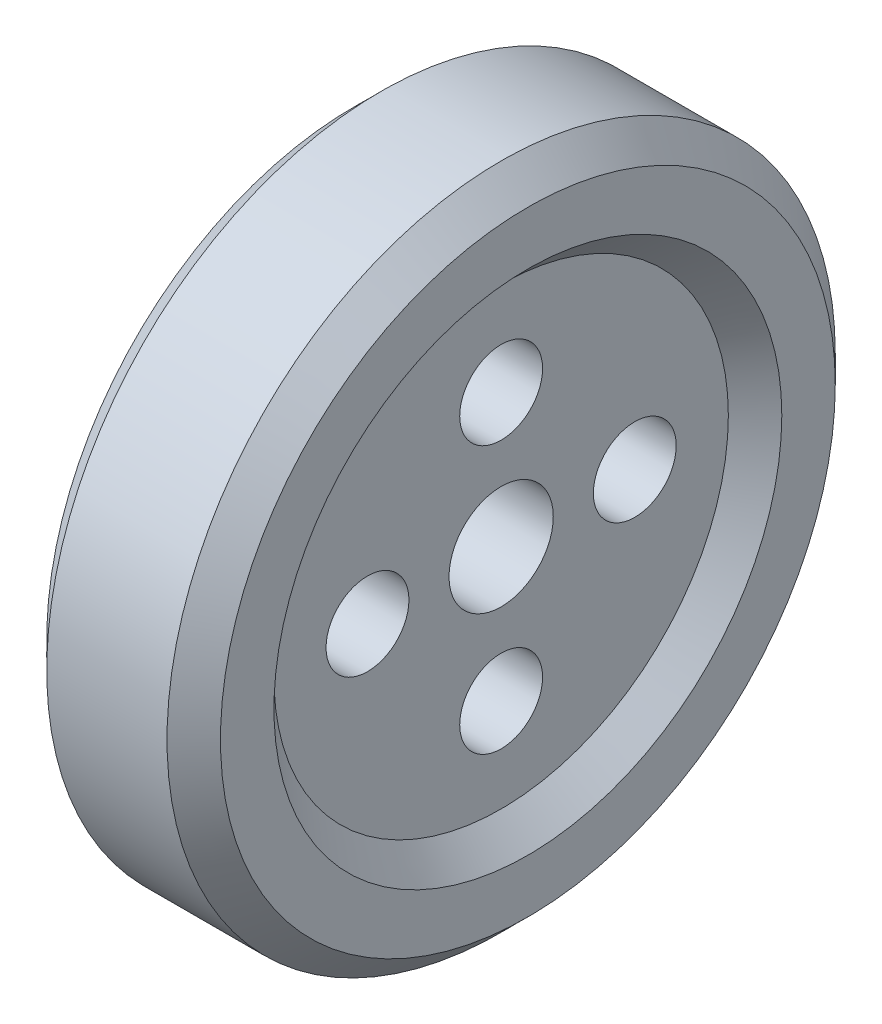
ISO-10303-21;
HEADER;
FILE_DESCRIPTION(('STEP AP214'),'2;1');
FILE_NAME('part.step','',(''),(''),'','','');
FILE_SCHEMA(('AUTOMOTIVE_DESIGN { 1 0 10303 214 1 1 1 1 }'));
ENDSEC;
DATA;
#1=APPLICATION_CONTEXT('core data for automotive mechanical design processes');
#2=APPLICATION_PROTOCOL_DEFINITION('international standard','automotive_design',2000,#1);
#3=PRODUCT_CONTEXT('',#1,'mechanical');
#4=PRODUCT('Part','Part','',(#3));
#5=PRODUCT_RELATED_PRODUCT_CATEGORY('part','',(#4));
#6=PRODUCT_DEFINITION_FORMATION('','',#4);
#7=PRODUCT_DEFINITION_CONTEXT('part definition',#1,'design');
#8=PRODUCT_DEFINITION('design','',#6,#7);
#9=PRODUCT_DEFINITION_SHAPE('','',#8);
#10=(LENGTH_UNIT() NAMED_UNIT(*) SI_UNIT(.MILLI.,.METRE.));
#11=(NAMED_UNIT(*) PLANE_ANGLE_UNIT() SI_UNIT($,.RADIAN.));
#12=(NAMED_UNIT(*) SI_UNIT($,.STERADIAN.) SOLID_ANGLE_UNIT());
#13=UNCERTAINTY_MEASURE_WITH_UNIT(LENGTH_MEASURE(1.E-05),#10,'distance_accuracy_value','');
#14=(GEOMETRIC_REPRESENTATION_CONTEXT(3) GLOBAL_UNCERTAINTY_ASSIGNED_CONTEXT((#13)) GLOBAL_UNIT_ASSIGNED_CONTEXT((#10,
#11,#12)) REPRESENTATION_CONTEXT('',''));
#15=CARTESIAN_POINT('',(0.,0.,0.));
#16=DIRECTION('',(0.,0.,1.));
#17=DIRECTION('',(1.,0.,0.));
#18=AXIS2_PLACEMENT_3D('',#15,#16,#17);
#19=CARTESIAN_POINT('',(-928.470993895784,140.989010989011,0.));
#20=DIRECTION('',(-1.,0.,0.));
#21=DIRECTION('',(0.,0.,1.));
#22=AXIS2_PLACEMENT_3D('',#19,#20,#21);
#23=CONICAL_SURFACE('',#22,190.,0.785398163397454);
#24=CARTESIAN_POINT('',(-908.470993895784,140.989010989011,0.));
#25=DIRECTION('',(1.,0.,0.));
#26=DIRECTION('',(0.,0.,-1.));
#27=AXIS2_PLACEMENT_3D('',#24,#25,#26);
#28=CIRCLE('',#27,170.);
#29=CARTESIAN_POINT('',(-908.470993895784,140.989010989011,-170.));
#30=VERTEX_POINT('',#29);
#31=EDGE_CURVE('E10',#30,#30,#28,.T.);
#32=ORIENTED_EDGE('',*,*,#31,.T.);
#33=EDGE_LOOP('',(#32));
#34=FACE_BOUND('',#33,.T.);
#35=CARTESIAN_POINT('',(-928.470993895784,140.989010989011,0.));
#36=DIRECTION('',(1.,0.,0.));
#37=DIRECTION('',(0.,0.,-1.));
#38=AXIS2_PLACEMENT_3D('',#35,#36,#37);
#39=CIRCLE('',#38,190.);
#40=CARTESIAN_POINT('',(-928.470993895784,140.989010989011,-190.));
#41=VERTEX_POINT('',#40);
#42=EDGE_CURVE('E50',#41,#41,#39,.T.);
#43=ORIENTED_EDGE('',*,*,#42,.F.);
#44=EDGE_LOOP('',(#43));
#45=FACE_BOUND('',#44,.T.);
#46=ADVANCED_FACE('F31',(#34,#45),#23,.F.);
#47=CARTESIAN_POINT('',(-908.470993895784,310.989010989011,0.));
#48=DIRECTION('',(-1.,0.,0.));
#49=DIRECTION('',(0.,0.,1.));
#50=AXIS2_PLACEMENT_3D('',#47,#48,#49);
#51=PLANE('',#50);
#52=CARTESIAN_POINT('',(-908.470993895784,40.989010989011,-1.08246744900953E-12));
#53=DIRECTION('',(-1.,0.,0.));
#54=DIRECTION('',(0.,0.,1.));
#55=AXIS2_PLACEMENT_3D('',#52,#53,#54);
#56=CIRCLE('',#55,31.);
#57=CARTESIAN_POINT('',(-908.470993895784,40.989010989011,30.9999999999989));
#58=VERTEX_POINT('',#57);
#59=EDGE_CURVE('E160',#58,#58,#56,.T.);
#60=ORIENTED_EDGE('',*,*,#59,.F.);
#61=EDGE_LOOP('',(#60));
#62=FACE_BOUND('',#61,.T.);
#63=CARTESIAN_POINT('',(-908.470993895784,140.98901098901,100.));
#64=DIRECTION('',(-1.,0.,0.));
#65=DIRECTION('',(0.,0.,1.));
#66=AXIS2_PLACEMENT_3D('',#63,#64,#65);
#67=CIRCLE('',#66,31.);
#68=CARTESIAN_POINT('',(-908.470993895784,140.98901098901,131.));
#69=VERTEX_POINT('',#68);
#70=EDGE_CURVE('E158',#69,#69,#67,.T.);
#71=ORIENTED_EDGE('',*,*,#70,.F.);
#72=EDGE_LOOP('',(#71));
#73=FACE_BOUND('',#72,.T.);
#74=CARTESIAN_POINT('',(-908.470993895784,240.989010989011,3.88578058618805E-13));
#75=DIRECTION('',(-1.,0.,0.));
#76=DIRECTION('',(0.,0.,1.));
#77=AXIS2_PLACEMENT_3D('',#74,#75,#76);
#78=CIRCLE('',#77,31.);
#79=CARTESIAN_POINT('',(-908.470993895784,240.989010989011,31.0000000000004));
#80=VERTEX_POINT('',#79);
#81=EDGE_CURVE('E71',#80,#80,#78,.T.);
#82=ORIENTED_EDGE('',*,*,#81,.F.);
#83=EDGE_LOOP('',(#82));
#84=FACE_BOUND('',#83,.T.);
#85=CARTESIAN_POINT('',(-908.470993895784,140.989010989011,-100.));
#86=DIRECTION('',(-1.,0.,0.));
#87=DIRECTION('',(0.,0.,1.));
#88=AXIS2_PLACEMENT_3D('',#85,#86,#87);
#89=CIRCLE('',#88,31.);
#90=CARTESIAN_POINT('',(-908.470993895784,140.989010989011,-69.));
#91=VERTEX_POINT('',#90);
#92=EDGE_CURVE('E56',#91,#91,#89,.T.);
#93=ORIENTED_EDGE('',*,*,#92,.F.);
#94=EDGE_LOOP('',(#93));
#95=FACE_BOUND('',#94,.T.);
#96=CARTESIAN_POINT('',(-908.470993895784,140.989010989011,0.));
#97=DIRECTION('',(-1.,0.,0.));
#98=DIRECTION('',(0.,0.,1.));
#99=AXIS2_PLACEMENT_3D('',#96,#97,#98);
#100=CIRCLE('',#99,39.);
#101=CARTESIAN_POINT('',(-908.470993895784,140.989010989011,39.));
#102=VERTEX_POINT('',#101);
#103=EDGE_CURVE('E51',#102,#102,#100,.T.);
#104=ORIENTED_EDGE('',*,*,#103,.F.);
#105=EDGE_LOOP('',(#104));
#106=FACE_BOUND('',#105,.T.);
#107=ORIENTED_EDGE('',*,*,#31,.F.);
#108=EDGE_LOOP('',(#107));
#109=FACE_BOUND('',#108,.T.);
#110=ADVANCED_FACE('F107',(#62,#73,#84,#95,#106,#109),#51,.T.);
#111=CARTESIAN_POINT('',(-818.470993895784,310.989010989011,0.));
#112=DIRECTION('',(1.,0.,0.));
#113=DIRECTION('',(0.,0.,-1.));
#114=AXIS2_PLACEMENT_3D('',#111,#112,#113);
#115=PLANE('',#114);
#116=CARTESIAN_POINT('',(-818.470993895784,40.989010989011,-1.08246744900953E-12));
#117=DIRECTION('',(1.,0.,0.));
#118=DIRECTION('',(0.,0.,-1.));
#119=AXIS2_PLACEMENT_3D('',#116,#117,#118);
#120=CIRCLE('',#119,31.);
#121=CARTESIAN_POINT('',(-818.470993895784,40.989010989011,-31.0000000000011));
#122=VERTEX_POINT('',#121);
#123=EDGE_CURVE('E34',#122,#122,#120,.T.);
#124=ORIENTED_EDGE('',*,*,#123,.F.);
#125=EDGE_LOOP('',(#124));
#126=FACE_BOUND('',#125,.T.);
#127=CARTESIAN_POINT('',(-818.470993895784,140.98901098901,100.));
#128=DIRECTION('',(1.,0.,0.));
#129=DIRECTION('',(0.,0.,-1.));
#130=AXIS2_PLACEMENT_3D('',#127,#128,#129);
#131=CIRCLE('',#130,31.);
#132=CARTESIAN_POINT('',(-818.470993895784,140.98901098901,69.));
#133=VERTEX_POINT('',#132);
#134=EDGE_CURVE('E58',#133,#133,#131,.T.);
#135=ORIENTED_EDGE('',*,*,#134,.F.);
#136=EDGE_LOOP('',(#135));
#137=FACE_BOUND('',#136,.T.);
#138=CARTESIAN_POINT('',(-818.470993895784,240.989010989011,3.88578058618805E-13));
#139=DIRECTION('',(1.,0.,0.));
#140=DIRECTION('',(0.,0.,-1.));
#141=AXIS2_PLACEMENT_3D('',#138,#139,#140);
#142=CIRCLE('',#141,31.);
#143=CARTESIAN_POINT('',(-818.470993895784,240.989010989011,-30.9999999999996));
#144=VERTEX_POINT('',#143);
#145=EDGE_CURVE('E55',#144,#144,#142,.T.);
#146=ORIENTED_EDGE('',*,*,#145,.F.);
#147=EDGE_LOOP('',(#146));
#148=FACE_BOUND('',#147,.T.);
#149=CARTESIAN_POINT('',(-818.470993895784,140.989010989011,-100.));
#150=DIRECTION('',(1.,0.,0.));
#151=DIRECTION('',(0.,0.,-1.));
#152=AXIS2_PLACEMENT_3D('',#149,#150,#151);
#153=CIRCLE('',#152,31.);
#154=CARTESIAN_POINT('',(-818.470993895784,140.989010989011,-131.));
#155=VERTEX_POINT('',#154);
#156=EDGE_CURVE('E52',#155,#155,#153,.T.);
#157=ORIENTED_EDGE('',*,*,#156,.F.);
#158=EDGE_LOOP('',(#157));
#159=FACE_BOUND('',#158,.T.);
#160=CARTESIAN_POINT('',(-818.470993895784,140.989010989011,0.));
#161=DIRECTION('',(1.,0.,0.));
#162=DIRECTION('',(0.,0.,-1.));
#163=AXIS2_PLACEMENT_3D('',#160,#161,#162);
#164=CIRCLE('',#163,39.);
#165=CARTESIAN_POINT('',(-818.470993895784,140.989010989011,-39.));
#166=VERTEX_POINT('',#165);
#167=EDGE_CURVE('E47',#166,#166,#164,.T.);
#168=ORIENTED_EDGE('',*,*,#167,.F.);
#169=EDGE_LOOP('',(#168));
#170=FACE_BOUND('',#169,.T.);
#171=CARTESIAN_POINT('',(-818.470993895784,140.989010989011,0.));
#172=DIRECTION('',(1.,0.,0.));
#173=DIRECTION('',(0.,0.,-1.));
#174=AXIS2_PLACEMENT_3D('',#171,#172,#173);
#175=CIRCLE('',#174,170.);
#176=CARTESIAN_POINT('',(-818.470993895784,140.989010989011,-170.));
#177=VERTEX_POINT('',#176);
#178=EDGE_CURVE('E38',#177,#177,#175,.T.);
#179=ORIENTED_EDGE('',*,*,#178,.T.);
#180=EDGE_LOOP('',(#179));
#181=FACE_BOUND('',#180,.T.);
#182=ADVANCED_FACE('F104',(#126,#137,#148,#159,#170,#181),#115,.T.);
#183=CARTESIAN_POINT('',(-818.470993895784,140.989010989011,0.));
#184=DIRECTION('',(1.,0.,0.));
#185=DIRECTION('',(0.,0.,-1.));
#186=AXIS2_PLACEMENT_3D('',#183,#184,#185);
#187=CONICAL_SURFACE('',#186,170.,0.785398163397448);
#188=CARTESIAN_POINT('',(-798.470993895784,140.989010989011,0.));
#189=DIRECTION('',(1.,0.,0.));
#190=DIRECTION('',(0.,0.,-1.));
#191=AXIS2_PLACEMENT_3D('',#188,#189,#190);
#192=CIRCLE('',#191,190.);
#193=CARTESIAN_POINT('',(-798.470993895784,140.989010989011,-190.));
#194=VERTEX_POINT('',#193);
#195=EDGE_CURVE('E43',#194,#194,#192,.T.);
#196=ORIENTED_EDGE('',*,*,#195,.T.);
#197=EDGE_LOOP('',(#196));
#198=FACE_BOUND('',#197,.T.);
#199=ORIENTED_EDGE('',*,*,#178,.F.);
#200=EDGE_LOOP('',(#199));
#201=FACE_BOUND('',#200,.T.);
#202=ADVANCED_FACE('F89',(#198,#201),#187,.F.);
#203=CARTESIAN_POINT('',(-798.470993895784,370.989010989011,0.));
#204=DIRECTION('',(1.,0.,0.));
#205=DIRECTION('',(0.,0.,-1.));
#206=AXIS2_PLACEMENT_3D('',#203,#204,#205);
#207=PLANE('',#206);
#208=CARTESIAN_POINT('',(-798.470993895784,140.989010989011,0.));
#209=DIRECTION('',(1.,0.,0.));
#210=DIRECTION('',(0.,0.,-1.));
#211=AXIS2_PLACEMENT_3D('',#208,#209,#210);
#212=CIRCLE('',#211,230.);
#213=CARTESIAN_POINT('',(-798.470993895784,140.989010989011,-230.));
#214=VERTEX_POINT('',#213);
#215=EDGE_CURVE('E84',#214,#214,#212,.T.);
#216=ORIENTED_EDGE('',*,*,#215,.T.);
#217=EDGE_LOOP('',(#216));
#218=FACE_BOUND('',#217,.T.);
#219=ORIENTED_EDGE('',*,*,#195,.F.);
#220=EDGE_LOOP('',(#219));
#221=FACE_BOUND('',#220,.T.);
#222=ADVANCED_FACE('F92',(#218,#221),#207,.T.);
#223=CARTESIAN_POINT('',(-798.470993895784,140.989010989011,0.));
#224=DIRECTION('',(-1.,0.,0.));
#225=DIRECTION('',(0.,0.,1.));
#226=AXIS2_PLACEMENT_3D('',#223,#224,#225);
#227=CONICAL_SURFACE('',#226,230.,0.785398163397448);
#228=CARTESIAN_POINT('',(-818.470993895784,140.989010989011,0.));
#229=DIRECTION('',(1.,0.,0.));
#230=DIRECTION('',(0.,0.,-1.));
#231=AXIS2_PLACEMENT_3D('',#228,#229,#230);
#232=CIRCLE('',#231,250.);
#233=CARTESIAN_POINT('',(-818.470993895784,140.989010989011,-250.));
#234=VERTEX_POINT('',#233);
#235=EDGE_CURVE('E81',#234,#234,#232,.T.);
#236=ORIENTED_EDGE('',*,*,#235,.T.);
#237=EDGE_LOOP('',(#236));
#238=FACE_BOUND('',#237,.T.);
#239=ORIENTED_EDGE('',*,*,#215,.F.);
#240=EDGE_LOOP('',(#239));
#241=FACE_BOUND('',#240,.T.);
#242=ADVANCED_FACE('F94',(#238,#241),#227,.T.);
#243=CARTESIAN_POINT('',(-690.973356143631,140.989010989011,0.));
#244=DIRECTION('',(1.,0.,0.));
#245=DIRECTION('',(0.,0.,-1.));
#246=AXIS2_PLACEMENT_3D('',#243,#244,#245);
#247=CYLINDRICAL_SURFACE('',#246,250.);
#248=CARTESIAN_POINT('',(-908.470993895784,140.989010989011,0.));
#249=DIRECTION('',(1.,0.,0.));
#250=DIRECTION('',(0.,0.,-1.));
#251=AXIS2_PLACEMENT_3D('',#248,#249,#250);
#252=CIRCLE('',#251,250.);
#253=CARTESIAN_POINT('',(-908.470993895784,140.989010989011,-250.));
#254=VERTEX_POINT('',#253);
#255=EDGE_CURVE('E78',#254,#254,#252,.T.);
#256=ORIENTED_EDGE('',*,*,#255,.T.);
#257=EDGE_LOOP('',(#256));
#258=FACE_BOUND('',#257,.T.);
#259=ORIENTED_EDGE('',*,*,#235,.F.);
#260=EDGE_LOOP('',(#259));
#261=FACE_BOUND('',#260,.T.);
#262=ADVANCED_FACE('F101',(#258,#261),#247,.T.);
#263=CARTESIAN_POINT('',(-908.470993895784,140.989010989011,0.));
#264=DIRECTION('',(1.,0.,0.));
#265=DIRECTION('',(0.,0.,-1.));
#266=AXIS2_PLACEMENT_3D('',#263,#264,#265);
#267=CONICAL_SURFACE('',#266,250.,0.785398163397448);
#268=CARTESIAN_POINT('',(-928.470993895784,140.989010989011,0.));
#269=DIRECTION('',(1.,0.,0.));
#270=DIRECTION('',(0.,0.,-1.));
#271=AXIS2_PLACEMENT_3D('',#268,#269,#270);
#272=CIRCLE('',#271,230.);
#273=CARTESIAN_POINT('',(-928.470993895784,140.989010989011,-230.));
#274=VERTEX_POINT('',#273);
#275=EDGE_CURVE('E75',#274,#274,#272,.T.);
#276=ORIENTED_EDGE('',*,*,#275,.T.);
#277=EDGE_LOOP('',(#276));
#278=FACE_BOUND('',#277,.T.);
#279=ORIENTED_EDGE('',*,*,#255,.F.);
#280=EDGE_LOOP('',(#279));
#281=FACE_BOUND('',#280,.T.);
#282=ADVANCED_FACE('F119',(#278,#281),#267,.T.);
#283=CARTESIAN_POINT('',(-928.470993895784,370.989010989011,0.));
#284=DIRECTION('',(-1.,0.,0.));
#285=DIRECTION('',(0.,0.,1.));
#286=AXIS2_PLACEMENT_3D('',#283,#284,#285);
#287=PLANE('',#286);
#288=ORIENTED_EDGE('',*,*,#42,.T.);
#289=EDGE_LOOP('',(#288));
#290=FACE_BOUND('',#289,.T.);
#291=ORIENTED_EDGE('',*,*,#275,.F.);
#292=EDGE_LOOP('',(#291));
#293=FACE_BOUND('',#292,.T.);
#294=ADVANCED_FACE('F115',(#290,#293),#287,.T.);
#295=CARTESIAN_POINT('',(-798.470993895784,140.989010989011,0.));
#296=DIRECTION('',(-1.,0.,0.));
#297=DIRECTION('',(0.,0.,1.));
#298=AXIS2_PLACEMENT_3D('',#295,#296,#297);
#299=CYLINDRICAL_SURFACE('',#298,39.);
#300=ORIENTED_EDGE('',*,*,#167,.T.);
#301=EDGE_LOOP('',(#300));
#302=FACE_BOUND('',#301,.T.);
#303=ORIENTED_EDGE('',*,*,#103,.T.);
#304=EDGE_LOOP('',(#303));
#305=FACE_BOUND('',#304,.T.);
#306=ADVANCED_FACE('F118',(#302,#305),#299,.F.);
#307=CARTESIAN_POINT('',(-798.470993895784,140.989010989011,-100.));
#308=DIRECTION('',(-1.,0.,0.));
#309=DIRECTION('',(0.,0.,1.));
#310=AXIS2_PLACEMENT_3D('',#307,#308,#309);
#311=CYLINDRICAL_SURFACE('',#310,31.);
#312=ORIENTED_EDGE('',*,*,#156,.T.);
#313=EDGE_LOOP('',(#312));
#314=FACE_BOUND('',#313,.T.);
#315=ORIENTED_EDGE('',*,*,#92,.T.);
#316=EDGE_LOOP('',(#315));
#317=FACE_BOUND('',#316,.T.);
#318=ADVANCED_FACE('F139',(#314,#317),#311,.F.);
#319=CARTESIAN_POINT('',(-798.470993895784,240.989010989011,3.88578058618805E-13));
#320=DIRECTION('',(-1.,0.,0.));
#321=DIRECTION('',(0.,0.,1.));
#322=AXIS2_PLACEMENT_3D('',#319,#320,#321);
#323=CYLINDRICAL_SURFACE('',#322,31.);
#324=ORIENTED_EDGE('',*,*,#145,.T.);
#325=EDGE_LOOP('',(#324));
#326=FACE_BOUND('',#325,.T.);
#327=ORIENTED_EDGE('',*,*,#81,.T.);
#328=EDGE_LOOP('',(#327));
#329=FACE_BOUND('',#328,.T.);
#330=ADVANCED_FACE('F141',(#326,#329),#323,.F.);
#331=CARTESIAN_POINT('',(-798.470993895784,140.98901098901,100.));
#332=DIRECTION('',(-1.,0.,0.));
#333=DIRECTION('',(0.,0.,1.));
#334=AXIS2_PLACEMENT_3D('',#331,#332,#333);
#335=CYLINDRICAL_SURFACE('',#334,31.);
#336=ORIENTED_EDGE('',*,*,#134,.T.);
#337=EDGE_LOOP('',(#336));
#338=FACE_BOUND('',#337,.T.);
#339=ORIENTED_EDGE('',*,*,#70,.T.);
#340=EDGE_LOOP('',(#339));
#341=FACE_BOUND('',#340,.T.);
#342=ADVANCED_FACE('F144',(#338,#341),#335,.F.);
#343=CARTESIAN_POINT('',(-798.470993895784,40.989010989011,-1.08246744900953E-12));
#344=DIRECTION('',(-1.,0.,0.));
#345=DIRECTION('',(0.,0.,1.));
#346=AXIS2_PLACEMENT_3D('',#343,#344,#345);
#347=CYLINDRICAL_SURFACE('',#346,31.);
#348=ORIENTED_EDGE('',*,*,#123,.T.);
#349=EDGE_LOOP('',(#348));
#350=FACE_BOUND('',#349,.T.);
#351=ORIENTED_EDGE('',*,*,#59,.T.);
#352=EDGE_LOOP('',(#351));
#353=FACE_BOUND('',#352,.T.);
#354=ADVANCED_FACE('F149',(#350,#353),#347,.F.);
#355=CLOSED_SHELL('',(#46,#110,#182,#202,#222,#242,#262,#282,#294,#306,#318,#330,#342,#354));
#356=MANIFOLD_SOLID_BREP('B2',#355);
#357=ADVANCED_BREP_SHAPE_REPRESENTATION('',(#18,#356),#14);
#358=SHAPE_DEFINITION_REPRESENTATION(#9,#357);
ENDSEC;
END-ISO-10303-21;
